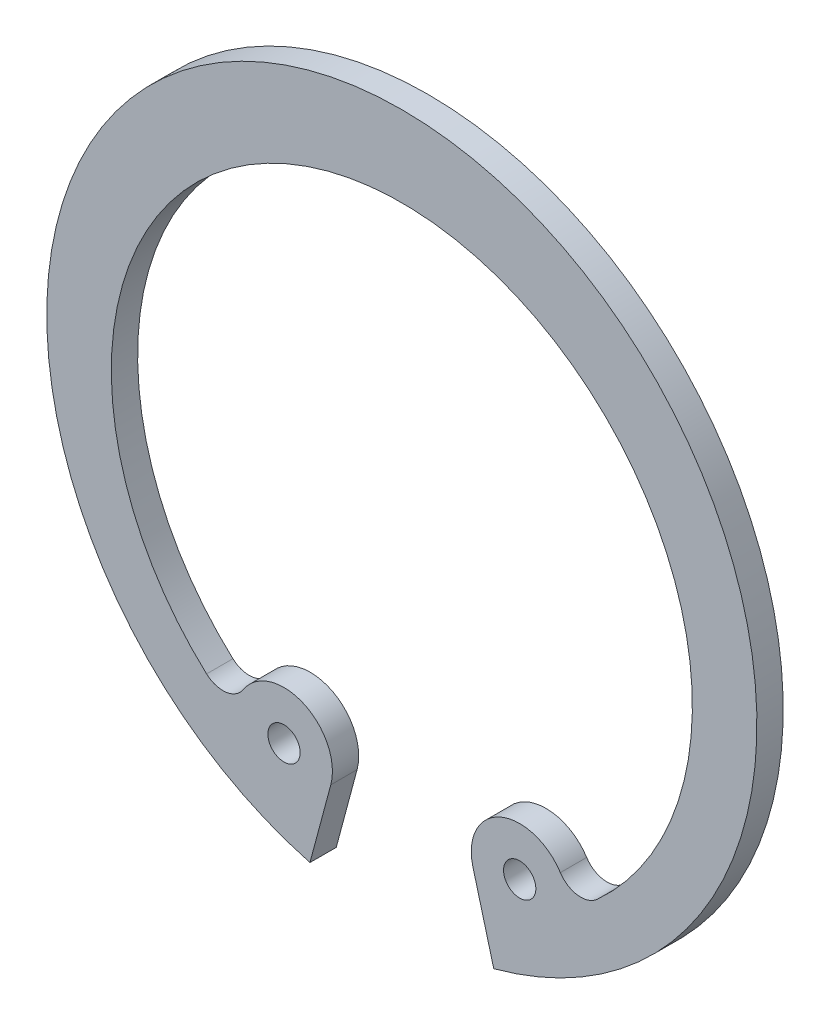
ISO-10303-21;
HEADER;
FILE_DESCRIPTION(('STEP AP214'),'2;1');
FILE_NAME('part.step','',(''),(''),'','','');
FILE_SCHEMA(('AUTOMOTIVE_DESIGN { 1 0 10303 214 1 1 1 1 }'));
ENDSEC;
DATA;
#1=APPLICATION_CONTEXT('core data for automotive mechanical design processes');
#2=APPLICATION_PROTOCOL_DEFINITION('international standard','automotive_design',2000,#1);
#3=PRODUCT_CONTEXT('',#1,'mechanical');
#4=PRODUCT('Part','Part','',(#3));
#5=PRODUCT_RELATED_PRODUCT_CATEGORY('part','',(#4));
#6=PRODUCT_DEFINITION_FORMATION('','',#4);
#7=PRODUCT_DEFINITION_CONTEXT('part definition',#1,'design');
#8=PRODUCT_DEFINITION('design','',#6,#7);
#9=PRODUCT_DEFINITION_SHAPE('','',#8);
#10=(LENGTH_UNIT() NAMED_UNIT(*) SI_UNIT(.MILLI.,.METRE.));
#11=(NAMED_UNIT(*) PLANE_ANGLE_UNIT() SI_UNIT($,.RADIAN.));
#12=(NAMED_UNIT(*) SI_UNIT($,.STERADIAN.) SOLID_ANGLE_UNIT());
#13=UNCERTAINTY_MEASURE_WITH_UNIT(LENGTH_MEASURE(1.E-05),#10,'distance_accuracy_value','');
#14=(GEOMETRIC_REPRESENTATION_CONTEXT(3) GLOBAL_UNCERTAINTY_ASSIGNED_CONTEXT((#13)) GLOBAL_UNIT_ASSIGNED_CONTEXT((#10,
#11,#12)) REPRESENTATION_CONTEXT('',''));
#15=CARTESIAN_POINT('',(0.,0.,0.));
#16=DIRECTION('',(0.,0.,1.));
#17=DIRECTION('',(1.,0.,0.));
#18=AXIS2_PLACEMENT_3D('',#15,#16,#17);
#19=CARTESIAN_POINT('',(-4.48033380180288,-9.60810684415916,1.));
#20=DIRECTION('',(0.,0.,1.));
#21=DIRECTION('',(1.,0.,0.));
#22=AXIS2_PLACEMENT_3D('',#19,#20,#21);
#23=PLANE('',#22);
#24=CARTESIAN_POINT('',(4.48033380180288,-9.60810684415916,1.));
#25=DIRECTION('',(0.,0.,-1.));
#26=DIRECTION('',(-1.,0.,0.));
#27=AXIS2_PLACEMENT_3D('',#24,#25,#26);
#28=CIRCLE('',#27,0.613636363636364);
#29=CARTESIAN_POINT('',(3.86669743816651,-9.60810684415916,1.));
#30=VERTEX_POINT('',#29);
#31=EDGE_CURVE('E208',#30,#30,#28,.T.);
#32=ORIENTED_EDGE('',*,*,#31,.T.);
#33=EDGE_LOOP('',(#32));
#34=FACE_BOUND('',#33,.T.);
#35=CARTESIAN_POINT('',(-4.48033380180288,-9.60810684415916,1.));
#36=DIRECTION('',(0.,0.,1.));
#37=DIRECTION('',(1.,0.,0.));
#38=AXIS2_PLACEMENT_3D('',#35,#36,#37);
#39=CIRCLE('',#38,1.84090909090909);
#40=CARTESIAN_POINT('',(-2.70215216704346,-10.0845691771888,1.));
#41=VERTEX_POINT('',#40);
#42=CARTESIAN_POINT('',(-6.02694018873106,-8.60963052250466,1.));
#43=VERTEX_POINT('',#42);
#44=EDGE_CURVE('E134',#41,#43,#39,.T.);
#45=ORIENTED_EDGE('',*,*,#44,.T.);
#46=CARTESIAN_POINT('',(-6.80277564197648,-8.10875755565741,1.));
#47=DIRECTION('',(0.,0.,1.));
#48=DIRECTION('',(1.,0.,0.));
#49=AXIS2_PLACEMENT_3D('',#46,#47,#48);
#50=CIRCLE('',#49,0.92346866727079);
#51=CARTESIAN_POINT('',(-7.42341967679758,-8.79256700387516,1.));
#52=VERTEX_POINT('',#51);
#53=EDGE_CURVE('E101',#52,#43,#50,.T.);
#54=ORIENTED_EDGE('',*,*,#53,.F.);
#55=CARTESIAN_POINT('',(0.,-0.613636363636365,1.));
#56=DIRECTION('',(0.,0.,1.));
#57=DIRECTION('',(1.,0.,0.));
#58=AXIS2_PLACEMENT_3D('',#55,#56,#57);
#59=CIRCLE('',#58,11.0454545454545);
#60=CARTESIAN_POINT('',(7.42341967679758,-8.79256700387516,1.));
#61=VERTEX_POINT('',#60);
#62=EDGE_CURVE('E137',#61,#52,#59,.T.);
#63=ORIENTED_EDGE('',*,*,#62,.F.);
#64=CARTESIAN_POINT('',(6.80277564197647,-8.10875755565741,1.));
#65=DIRECTION('',(0.,0.,-1.));
#66=DIRECTION('',(-1.,0.,0.));
#67=AXIS2_PLACEMENT_3D('',#64,#65,#66);
#68=CIRCLE('',#67,0.92346866727079);
#69=CARTESIAN_POINT('',(6.02694018873106,-8.60963052250466,1.));
#70=VERTEX_POINT('',#69);
#71=EDGE_CURVE('E140',#61,#70,#68,.T.);
#72=ORIENTED_EDGE('',*,*,#71,.T.);
#73=CARTESIAN_POINT('',(4.48033380180288,-9.60810684415916,1.));
#74=DIRECTION('',(0.,0.,-1.));
#75=DIRECTION('',(-1.,0.,0.));
#76=AXIS2_PLACEMENT_3D('',#73,#74,#75);
#77=CIRCLE('',#76,1.84090909090909);
#78=CARTESIAN_POINT('',(2.70215216704345,-10.0845691771888,1.));
#79=VERTEX_POINT('',#78);
#80=EDGE_CURVE('E142',#79,#70,#77,.T.);
#81=ORIENTED_EDGE('',*,*,#80,.F.);
#82=DIRECTION('',(-0.258819045102515,0.96592582628907,0.));
#83=VECTOR('',#82,1.);
#84=CARTESIAN_POINT('',(3.49405710888394,-13.0399986549024,1.));
#85=LINE('',#84,#83);
#86=CARTESIAN_POINT('',(3.49405710888394,-13.0399986549024,1.));
#87=VERTEX_POINT('',#86);
#88=EDGE_CURVE('E145',#87,#79,#85,.T.);
#89=ORIENTED_EDGE('',*,*,#88,.F.);
#90=CARTESIAN_POINT('',(0.,0.,1.));
#91=DIRECTION('',(0.,0.,1.));
#92=DIRECTION('',(1.,0.,0.));
#93=AXIS2_PLACEMENT_3D('',#90,#91,#92);
#94=CIRCLE('',#93,13.5);
#95=CARTESIAN_POINT('',(-3.49405710888395,-13.0399986549024,1.));
#96=VERTEX_POINT('',#95);
#97=EDGE_CURVE('E50',#87,#96,#94,.T.);
#98=ORIENTED_EDGE('',*,*,#97,.T.);
#99=DIRECTION('',(0.258819045102515,0.96592582628907,0.));
#100=VECTOR('',#99,1.);
#101=CARTESIAN_POINT('',(-3.49405710888395,-13.0399986549024,1.));
#102=LINE('',#101,#100);
#103=EDGE_CURVE('E45',#96,#41,#102,.T.);
#104=ORIENTED_EDGE('',*,*,#103,.T.);
#105=EDGE_LOOP('',(#45,#54,#63,#72,#81,#89,#98,#104));
#106=FACE_BOUND('',#105,.T.);
#107=CARTESIAN_POINT('',(-4.48033380180288,-9.60810684415916,1.));
#108=DIRECTION('',(0.,0.,1.));
#109=DIRECTION('',(1.,0.,0.));
#110=AXIS2_PLACEMENT_3D('',#107,#108,#109);
#111=CIRCLE('',#110,0.613636363636363);
#112=CARTESIAN_POINT('',(-3.86669743816652,-9.60810684415916,1.));
#113=VERTEX_POINT('',#112);
#114=EDGE_CURVE('E110',#113,#113,#111,.T.);
#115=ORIENTED_EDGE('',*,*,#114,.F.);
#116=EDGE_LOOP('',(#115));
#117=FACE_BOUND('',#116,.T.);
#118=ADVANCED_FACE('F30',(#34,#106,#117),#23,.T.);
#119=CARTESIAN_POINT('',(-4.48033380180288,-9.60810684415916,0.));
#120=DIRECTION('',(0.,0.,1.));
#121=DIRECTION('',(1.,0.,0.));
#122=AXIS2_PLACEMENT_3D('',#119,#120,#121);
#123=PLANE('',#122);
#124=CARTESIAN_POINT('',(4.48033380180288,-9.60810684415916,0.));
#125=DIRECTION('',(0.,0.,-1.));
#126=DIRECTION('',(-1.,0.,0.));
#127=AXIS2_PLACEMENT_3D('',#124,#125,#126);
#128=CIRCLE('',#127,0.613636363636364);
#129=CARTESIAN_POINT('',(3.86669743816651,-9.60810684415916,0.));
#130=VERTEX_POINT('',#129);
#131=EDGE_CURVE('E211',#130,#130,#128,.T.);
#132=ORIENTED_EDGE('',*,*,#131,.F.);
#133=EDGE_LOOP('',(#132));
#134=FACE_BOUND('',#133,.T.);
#135=CARTESIAN_POINT('',(-4.48033380180288,-9.60810684415916,0.));
#136=DIRECTION('',(0.,0.,1.));
#137=DIRECTION('',(1.,0.,0.));
#138=AXIS2_PLACEMENT_3D('',#135,#136,#137);
#139=CIRCLE('',#138,1.84090909090909);
#140=CARTESIAN_POINT('',(-2.70215216704346,-10.0845691771888,0.));
#141=VERTEX_POINT('',#140);
#142=CARTESIAN_POINT('',(-6.02694018873106,-8.60963052250466,0.));
#143=VERTEX_POINT('',#142);
#144=EDGE_CURVE('E106',#141,#143,#139,.T.);
#145=ORIENTED_EDGE('',*,*,#144,.F.);
#146=DIRECTION('',(0.258819045102515,0.96592582628907,0.));
#147=VECTOR('',#146,1.);
#148=CARTESIAN_POINT('',(-3.49405710888395,-13.0399986549024,0.));
#149=LINE('',#148,#147);
#150=CARTESIAN_POINT('',(-3.49405710888395,-13.0399986549024,0.));
#151=VERTEX_POINT('',#150);
#152=EDGE_CURVE('E132',#151,#141,#149,.T.);
#153=ORIENTED_EDGE('',*,*,#152,.F.);
#154=CARTESIAN_POINT('',(0.,0.,0.));
#155=DIRECTION('',(0.,0.,1.));
#156=DIRECTION('',(1.,0.,0.));
#157=AXIS2_PLACEMENT_3D('',#154,#155,#156);
#158=CIRCLE('',#157,13.5);
#159=CARTESIAN_POINT('',(3.49405710888394,-13.0399986549024,0.));
#160=VERTEX_POINT('',#159);
#161=EDGE_CURVE('E130',#160,#151,#158,.T.);
#162=ORIENTED_EDGE('',*,*,#161,.F.);
#163=DIRECTION('',(-0.258819045102515,0.96592582628907,0.));
#164=VECTOR('',#163,1.);
#165=CARTESIAN_POINT('',(3.49405710888394,-13.0399986549024,0.));
#166=LINE('',#165,#164);
#167=CARTESIAN_POINT('',(2.70215216704345,-10.0845691771888,0.));
#168=VERTEX_POINT('',#167);
#169=EDGE_CURVE('E127',#160,#168,#166,.T.);
#170=ORIENTED_EDGE('',*,*,#169,.T.);
#171=CARTESIAN_POINT('',(4.48033380180288,-9.60810684415916,0.));
#172=DIRECTION('',(0.,0.,-1.));
#173=DIRECTION('',(-1.,0.,0.));
#174=AXIS2_PLACEMENT_3D('',#171,#172,#173);
#175=CIRCLE('',#174,1.84090909090909);
#176=CARTESIAN_POINT('',(6.02694018873106,-8.60963052250466,0.));
#177=VERTEX_POINT('',#176);
#178=EDGE_CURVE('E124',#168,#177,#175,.T.);
#179=ORIENTED_EDGE('',*,*,#178,.T.);
#180=CARTESIAN_POINT('',(6.80277564197647,-8.10875755565741,0.));
#181=DIRECTION('',(0.,0.,-1.));
#182=DIRECTION('',(-1.,0.,0.));
#183=AXIS2_PLACEMENT_3D('',#180,#181,#182);
#184=CIRCLE('',#183,0.92346866727079);
#185=CARTESIAN_POINT('',(7.42341967679758,-8.79256700387516,0.));
#186=VERTEX_POINT('',#185);
#187=EDGE_CURVE('E118',#186,#177,#184,.T.);
#188=ORIENTED_EDGE('',*,*,#187,.F.);
#189=CARTESIAN_POINT('',(0.,-0.613636363636365,0.));
#190=DIRECTION('',(0.,0.,1.));
#191=DIRECTION('',(1.,0.,0.));
#192=AXIS2_PLACEMENT_3D('',#189,#190,#191);
#193=CIRCLE('',#192,11.0454545454545);
#194=CARTESIAN_POINT('',(-7.42341967679758,-8.79256700387516,0.));
#195=VERTEX_POINT('',#194);
#196=EDGE_CURVE('E116',#186,#195,#193,.T.);
#197=ORIENTED_EDGE('',*,*,#196,.T.);
#198=CARTESIAN_POINT('',(-6.80277564197648,-8.10875755565741,0.));
#199=DIRECTION('',(0.,0.,1.));
#200=DIRECTION('',(1.,0.,0.));
#201=AXIS2_PLACEMENT_3D('',#198,#199,#200);
#202=CIRCLE('',#201,0.92346866727079);
#203=EDGE_CURVE('E98',#195,#143,#202,.T.);
#204=ORIENTED_EDGE('',*,*,#203,.T.);
#205=EDGE_LOOP('',(#145,#153,#162,#170,#179,#188,#197,#204));
#206=FACE_BOUND('',#205,.T.);
#207=CARTESIAN_POINT('',(-4.48033380180288,-9.60810684415916,0.));
#208=DIRECTION('',(0.,0.,1.));
#209=DIRECTION('',(1.,0.,0.));
#210=AXIS2_PLACEMENT_3D('',#207,#208,#209);
#211=CIRCLE('',#210,0.613636363636363);
#212=CARTESIAN_POINT('',(-3.86669743816652,-9.60810684415916,0.));
#213=VERTEX_POINT('',#212);
#214=EDGE_CURVE('E213',#213,#213,#211,.T.);
#215=ORIENTED_EDGE('',*,*,#214,.T.);
#216=EDGE_LOOP('',(#215));
#217=FACE_BOUND('',#216,.T.);
#218=ADVANCED_FACE('F112',(#134,#206,#217),#123,.F.);
#219=CARTESIAN_POINT('',(-4.48033380180288,-9.60810684415916,1.));
#220=DIRECTION('',(0.,0.,-1.));
#221=DIRECTION('',(-1.,0.,0.));
#222=AXIS2_PLACEMENT_3D('',#219,#220,#221);
#223=CYLINDRICAL_SURFACE('',#222,1.84090909090909);
#224=ORIENTED_EDGE('',*,*,#144,.T.);
#225=DIRECTION('',(0.,0.,-1.));
#226=VECTOR('',#225,1.);
#227=CARTESIAN_POINT('',(-6.02694018873106,-8.60963052250466,1.));
#228=LINE('',#227,#226);
#229=EDGE_CURVE('E11',#43,#143,#228,.T.);
#230=ORIENTED_EDGE('',*,*,#229,.F.);
#231=ORIENTED_EDGE('',*,*,#44,.F.);
#232=DIRECTION('',(0.,0.,-1.));
#233=VECTOR('',#232,1.);
#234=CARTESIAN_POINT('',(-2.70215216704346,-10.0845691771888,1.));
#235=LINE('',#234,#233);
#236=EDGE_CURVE('E107',#41,#141,#235,.T.);
#237=ORIENTED_EDGE('',*,*,#236,.T.);
#238=EDGE_LOOP('',(#224,#230,#231,#237));
#239=FACE_BOUND('',#238,.T.);
#240=ADVANCED_FACE('F32',(#239),#223,.T.);
#241=CARTESIAN_POINT('',(-6.80277564197648,-8.10875755565741,1.));
#242=DIRECTION('',(0.,0.,-1.));
#243=DIRECTION('',(-1.,0.,0.));
#244=AXIS2_PLACEMENT_3D('',#241,#242,#243);
#245=CYLINDRICAL_SURFACE('',#244,0.92346866727079);
#246=ORIENTED_EDGE('',*,*,#203,.F.);
#247=DIRECTION('',(0.,0.,-1.));
#248=VECTOR('',#247,1.);
#249=CARTESIAN_POINT('',(-7.42341967679758,-8.79256700387516,1.));
#250=LINE('',#249,#248);
#251=EDGE_CURVE('E38',#52,#195,#250,.T.);
#252=ORIENTED_EDGE('',*,*,#251,.F.);
#253=ORIENTED_EDGE('',*,*,#53,.T.);
#254=ORIENTED_EDGE('',*,*,#229,.T.);
#255=EDGE_LOOP('',(#246,#252,#253,#254));
#256=FACE_BOUND('',#255,.T.);
#257=ADVANCED_FACE('F96',(#256),#245,.F.);
#258=CARTESIAN_POINT('',(0.,-0.613636363636365,1.));
#259=DIRECTION('',(0.,0.,-1.));
#260=DIRECTION('',(-1.,0.,0.));
#261=AXIS2_PLACEMENT_3D('',#258,#259,#260);
#262=CYLINDRICAL_SURFACE('',#261,11.0454545454545);
#263=ORIENTED_EDGE('',*,*,#196,.F.);
#264=DIRECTION('',(0.,0.,-1.));
#265=VECTOR('',#264,1.);
#266=CARTESIAN_POINT('',(7.42341967679758,-8.79256700387516,1.));
#267=LINE('',#266,#265);
#268=EDGE_CURVE('E160',#61,#186,#267,.T.);
#269=ORIENTED_EDGE('',*,*,#268,.F.);
#270=ORIENTED_EDGE('',*,*,#62,.T.);
#271=ORIENTED_EDGE('',*,*,#251,.T.);
#272=EDGE_LOOP('',(#263,#269,#270,#271));
#273=FACE_BOUND('',#272,.T.);
#274=ADVANCED_FACE('F162',(#273),#262,.F.);
#275=CARTESIAN_POINT('',(6.80277564197647,-8.10875755565741,1.));
#276=DIRECTION('',(0.,0.,-1.));
#277=DIRECTION('',(-1.,0.,0.));
#278=AXIS2_PLACEMENT_3D('',#275,#276,#277);
#279=CYLINDRICAL_SURFACE('',#278,0.92346866727079);
#280=ORIENTED_EDGE('',*,*,#187,.T.);
#281=DIRECTION('',(0.,0.,-1.));
#282=VECTOR('',#281,1.);
#283=CARTESIAN_POINT('',(6.02694018873106,-8.60963052250466,1.));
#284=LINE('',#283,#282);
#285=EDGE_CURVE('E158',#70,#177,#284,.T.);
#286=ORIENTED_EDGE('',*,*,#285,.F.);
#287=ORIENTED_EDGE('',*,*,#71,.F.);
#288=ORIENTED_EDGE('',*,*,#268,.T.);
#289=EDGE_LOOP('',(#280,#286,#287,#288));
#290=FACE_BOUND('',#289,.T.);
#291=ADVANCED_FACE('F169',(#290),#279,.F.);
#292=CARTESIAN_POINT('',(4.48033380180288,-9.60810684415916,1.));
#293=DIRECTION('',(0.,0.,-1.));
#294=DIRECTION('',(-1.,0.,0.));
#295=AXIS2_PLACEMENT_3D('',#292,#293,#294);
#296=CYLINDRICAL_SURFACE('',#295,1.84090909090909);
#297=ORIENTED_EDGE('',*,*,#178,.F.);
#298=DIRECTION('',(0.,0.,-1.));
#299=VECTOR('',#298,1.);
#300=CARTESIAN_POINT('',(2.70215216704345,-10.0845691771888,1.));
#301=LINE('',#300,#299);
#302=EDGE_CURVE('E156',#79,#168,#301,.T.);
#303=ORIENTED_EDGE('',*,*,#302,.F.);
#304=ORIENTED_EDGE('',*,*,#80,.T.);
#305=ORIENTED_EDGE('',*,*,#285,.T.);
#306=EDGE_LOOP('',(#297,#303,#304,#305));
#307=FACE_BOUND('',#306,.T.);
#308=ADVANCED_FACE('F172',(#307),#296,.T.);
#309=CARTESIAN_POINT('',(3.49405710888394,-13.0399986549024,1.));
#310=DIRECTION('',(-0.96592582628907,-0.258819045102515,0.));
#311=DIRECTION('',(0.258819045102515,-0.96592582628907,0.));
#312=AXIS2_PLACEMENT_3D('',#309,#310,#311);
#313=PLANE('',#312);
#314=ORIENTED_EDGE('',*,*,#169,.F.);
#315=DIRECTION('',(0.,0.,-1.));
#316=VECTOR('',#315,1.);
#317=CARTESIAN_POINT('',(3.49405710888394,-13.0399986549024,1.));
#318=LINE('',#317,#316);
#319=EDGE_CURVE('E154',#87,#160,#318,.T.);
#320=ORIENTED_EDGE('',*,*,#319,.F.);
#321=ORIENTED_EDGE('',*,*,#88,.T.);
#322=ORIENTED_EDGE('',*,*,#302,.T.);
#323=EDGE_LOOP('',(#314,#320,#321,#322));
#324=FACE_BOUND('',#323,.T.);
#325=ADVANCED_FACE('F175',(#324),#313,.T.);
#326=CARTESIAN_POINT('',(0.,0.,1.));
#327=DIRECTION('',(0.,0.,-1.));
#328=DIRECTION('',(-1.,0.,0.));
#329=AXIS2_PLACEMENT_3D('',#326,#327,#328);
#330=CYLINDRICAL_SURFACE('',#329,13.5);
#331=ORIENTED_EDGE('',*,*,#161,.T.);
#332=DIRECTION('',(0.,0.,-1.));
#333=VECTOR('',#332,1.);
#334=CARTESIAN_POINT('',(-3.49405710888395,-13.0399986549024,1.));
#335=LINE('',#334,#333);
#336=EDGE_CURVE('E151',#96,#151,#335,.T.);
#337=ORIENTED_EDGE('',*,*,#336,.F.);
#338=ORIENTED_EDGE('',*,*,#97,.F.);
#339=ORIENTED_EDGE('',*,*,#319,.T.);
#340=EDGE_LOOP('',(#331,#337,#338,#339));
#341=FACE_BOUND('',#340,.T.);
#342=ADVANCED_FACE('F178',(#341),#330,.T.);
#343=CARTESIAN_POINT('',(-3.49405710888395,-13.0399986549024,1.));
#344=DIRECTION('',(-0.96592582628907,0.258819045102515,0.));
#345=DIRECTION('',(-0.258819045102515,-0.96592582628907,0.));
#346=AXIS2_PLACEMENT_3D('',#343,#344,#345);
#347=PLANE('',#346);
#348=ORIENTED_EDGE('',*,*,#152,.T.);
#349=ORIENTED_EDGE('',*,*,#236,.F.);
#350=ORIENTED_EDGE('',*,*,#103,.F.);
#351=ORIENTED_EDGE('',*,*,#336,.T.);
#352=EDGE_LOOP('',(#348,#349,#350,#351));
#353=FACE_BOUND('',#352,.T.);
#354=ADVANCED_FACE('F180',(#353),#347,.F.);
#355=CARTESIAN_POINT('',(-4.48033380180288,-9.60810684415916,1.));
#356=DIRECTION('',(0.,0.,-1.));
#357=DIRECTION('',(-1.,0.,0.));
#358=AXIS2_PLACEMENT_3D('',#355,#356,#357);
#359=CYLINDRICAL_SURFACE('',#358,0.613636363636363);
#360=ORIENTED_EDGE('',*,*,#114,.T.);
#361=EDGE_LOOP('',(#360));
#362=FACE_BOUND('',#361,.T.);
#363=ORIENTED_EDGE('',*,*,#214,.F.);
#364=EDGE_LOOP('',(#363));
#365=FACE_BOUND('',#364,.T.);
#366=ADVANCED_FACE('F182',(#362,#365),#359,.F.);
#367=CARTESIAN_POINT('',(4.48033380180288,-9.60810684415916,1.));
#368=DIRECTION('',(0.,0.,-1.));
#369=DIRECTION('',(-1.,0.,0.));
#370=AXIS2_PLACEMENT_3D('',#367,#368,#369);
#371=CYLINDRICAL_SURFACE('',#370,0.613636363636364);
#372=ORIENTED_EDGE('',*,*,#31,.F.);
#373=EDGE_LOOP('',(#372));
#374=FACE_BOUND('',#373,.T.);
#375=ORIENTED_EDGE('',*,*,#131,.T.);
#376=EDGE_LOOP('',(#375));
#377=FACE_BOUND('',#376,.T.);
#378=ADVANCED_FACE('F188',(#374,#377),#371,.F.);
#379=CLOSED_SHELL('',(#118,#218,#240,#257,#274,#291,#308,#325,#342,#354,#366,#378));
#380=MANIFOLD_SOLID_BREP('B2',#379);
#381=ADVANCED_BREP_SHAPE_REPRESENTATION('',(#18,#380),#14);
#382=SHAPE_DEFINITION_REPRESENTATION(#9,#381);
ENDSEC;
END-ISO-10303-21;
